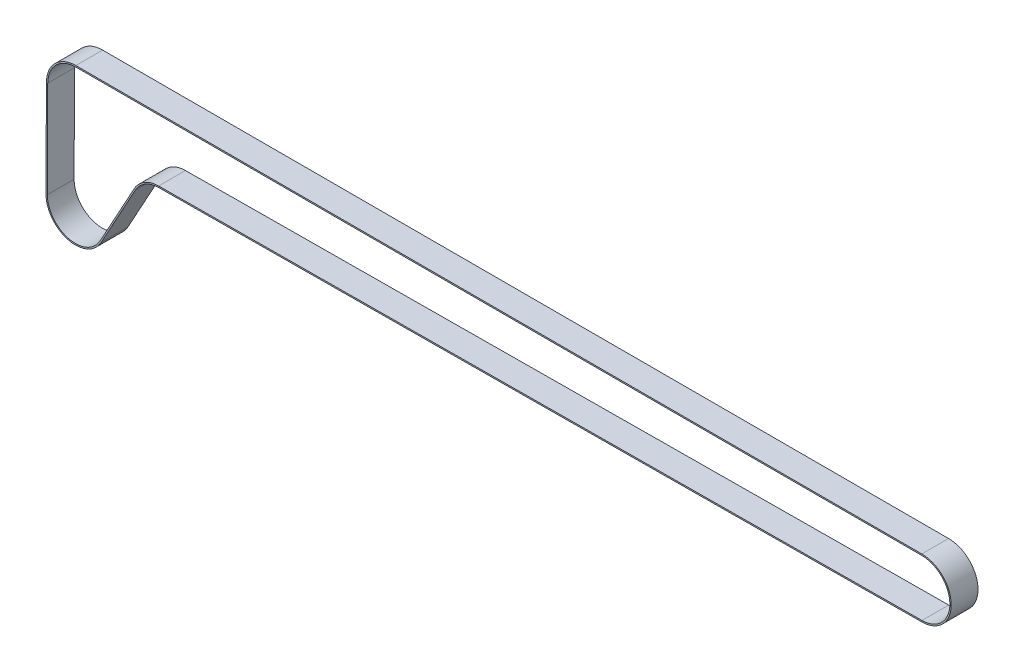
ISO-10303-21;
HEADER;
FILE_DESCRIPTION(('STEP AP214'),'2;1');
FILE_NAME('part.step','',(''),(''),'','','');
FILE_SCHEMA(('AUTOMOTIVE_DESIGN { 1 0 10303 214 1 1 1 1 }'));
ENDSEC;
DATA;
#1=APPLICATION_CONTEXT('core data for automotive mechanical design processes');
#2=APPLICATION_PROTOCOL_DEFINITION('international standard','automotive_design',2000,#1);
#3=PRODUCT_CONTEXT('',#1,'mechanical');
#4=PRODUCT('Part','Part','',(#3));
#5=PRODUCT_RELATED_PRODUCT_CATEGORY('part','',(#4));
#6=PRODUCT_DEFINITION_FORMATION('','',#4);
#7=PRODUCT_DEFINITION_CONTEXT('part definition',#1,'design');
#8=PRODUCT_DEFINITION('design','',#6,#7);
#9=PRODUCT_DEFINITION_SHAPE('','',#8);
#10=(LENGTH_UNIT() NAMED_UNIT(*) SI_UNIT(.MILLI.,.METRE.));
#11=(NAMED_UNIT(*) PLANE_ANGLE_UNIT() SI_UNIT($,.RADIAN.));
#12=(NAMED_UNIT(*) SI_UNIT($,.STERADIAN.) SOLID_ANGLE_UNIT());
#13=UNCERTAINTY_MEASURE_WITH_UNIT(LENGTH_MEASURE(1.E-05),#10,'distance_accuracy_value','');
#14=(GEOMETRIC_REPRESENTATION_CONTEXT(3) GLOBAL_UNCERTAINTY_ASSIGNED_CONTEXT((#13)) GLOBAL_UNIT_ASSIGNED_CONTEXT((#10,
#11,#12)) REPRESENTATION_CONTEXT('',''));
#15=CARTESIAN_POINT('',(0.,0.,0.));
#16=DIRECTION('',(0.,0.,1.));
#17=DIRECTION('',(1.,0.,0.));
#18=AXIS2_PLACEMENT_3D('',#15,#16,#17);
#19=CARTESIAN_POINT('',(-1.33134176832873E-09,-8.50560765364232E-12,2.5));
#20=DIRECTION('',(0.,0.,1.));
#21=DIRECTION('',(1.,0.,0.));
#22=AXIS2_PLACEMENT_3D('',#19,#20,#21);
#23=PLANE('',#22);
#24=CARTESIAN_POINT('',(-1.33134176832873E-09,-8.50560765364232E-12,2.5));
#25=DIRECTION('',(0.,0.,1.));
#26=DIRECTION('',(1.,0.,0.));
#27=AXIS2_PLACEMENT_3D('',#24,#25,#26);
#28=CIRCLE('',#27,11.);
#29=CARTESIAN_POINT('',(0.0771711362803629,-10.999729297383,2.5));
#30=VERTEX_POINT('',#29);
#31=CARTESIAN_POINT('',(0.,10.9999999999915,2.5));
#32=VERTEX_POINT('',#31);
#33=EDGE_CURVE('E259',#30,#32,#28,.T.);
#34=ORIENTED_EDGE('',*,*,#33,.T.);
#35=DIRECTION('',(-1.,0.,0.));
#36=VECTOR('',#35,1.);
#37=CARTESIAN_POINT('',(0.,10.9999999999915,2.5));
#38=LINE('',#37,#36);
#39=CARTESIAN_POINT('',(-316.000000000003,10.9999999999915,2.5));
#40=VERTEX_POINT('',#39);
#41=EDGE_CURVE('E262',#32,#40,#38,.T.);
#42=ORIENTED_EDGE('',*,*,#41,.T.);
#43=CARTESIAN_POINT('',(-316.000000000002,-8.52096171399808E-12,2.5));
#44=DIRECTION('',(0.,0.,1.));
#45=DIRECTION('',(1.,0.,0.));
#46=AXIS2_PLACEMENT_3D('',#43,#44,#45);
#47=CIRCLE('',#46,11.);
#48=CARTESIAN_POINT('',(-326.999905305886,0.0456427605963883,2.5));
#49=VERTEX_POINT('',#48);
#50=EDGE_CURVE('E265',#40,#49,#47,.T.);
#51=ORIENTED_EDGE('',*,*,#50,.T.);
#52=DIRECTION('',(-0.00414934187317357,-0.999991391443956,0.));
#53=VECTOR('',#52,1.);
#54=CARTESIAN_POINT('',(-326.999905305886,0.0456427605963884,2.5));
#55=LINE('',#54,#53);
#56=CARTESIAN_POINT('',(-327.149905305884,-36.1043572394084,2.5));
#57=VERTEX_POINT('',#56);
#58=EDGE_CURVE('E267',#49,#57,#55,.T.);
#59=ORIENTED_EDGE('',*,*,#58,.T.);
#60=CARTESIAN_POINT('',(-316.150000000001,-36.1500000000133,2.5));
#61=DIRECTION('',(0.,0.,1.));
#62=DIRECTION('',(1.,0.,0.));
#63=AXIS2_PLACEMENT_3D('',#60,#61,#62);
#64=CIRCLE('',#63,11.);
#65=CARTESIAN_POINT('',(-306.503020259219,-41.4354310969946,2.5));
#66=VERTEX_POINT('',#65);
#67=EDGE_CURVE('E269',#57,#66,#64,.T.);
#68=ORIENTED_EDGE('',*,*,#67,.T.);
#69=DIRECTION('',(0.480493736089203,0.876998158252934,0.));
#70=VECTOR('',#69,1.);
#71=CARTESIAN_POINT('',(-306.503020259219,-41.4354310969946,2.5));
#72=LINE('',#71,#70);
#73=CARTESIAN_POINT('',(-293.769981582528,-18.1950626391047,2.5));
#74=VERTEX_POINT('',#73);
#75=EDGE_CURVE('E271',#66,#74,#72,.T.);
#76=ORIENTED_EDGE('',*,*,#75,.T.);
#77=CARTESIAN_POINT('',(-284.999999999999,-22.9999999999967,2.5));
#78=DIRECTION('',(0.,0.,1.));
#79=DIRECTION('',(1.,0.,0.));
#80=AXIS2_PLACEMENT_3D('',#77,#78,#79);
#81=CIRCLE('',#80,9.99999999999999);
#82=CARTESIAN_POINT('',(-285.070155578435,-13.0002460932841,2.5));
#83=VERTEX_POINT('',#82);
#84=EDGE_CURVE('E273',#74,#83,#81,.F.);
#85=ORIENTED_EDGE('',*,*,#84,.T.);
#86=DIRECTION('',(0.999975390671262,0.00701555784363707,0.));
#87=VECTOR('',#86,1.);
#88=CARTESIAN_POINT('',(-285.070155578435,-13.0002460932841,2.5));
#89=LINE('',#88,#87);
#90=EDGE_CURVE('E275',#83,#30,#89,.T.);
#91=ORIENTED_EDGE('',*,*,#90,.T.);
#92=EDGE_LOOP('',(#34,#42,#51,#59,#68,#76,#85,#91));
#93=FACE_BOUND('',#92,.T.);
#94=DIRECTION('',(-1.,0.,0.));
#95=VECTOR('',#94,1.);
#96=CARTESIAN_POINT('',(0.,10.4999999999915,2.5));
#97=LINE('',#96,#95);
#98=CARTESIAN_POINT('',(0.,10.4999999999915,2.5));
#99=VERTEX_POINT('',#98);
#100=CARTESIAN_POINT('',(-316.000000000003,10.4999999999915,2.5));
#101=VERTEX_POINT('',#100);
#102=EDGE_CURVE('E202',#99,#101,#97,.T.);
#103=ORIENTED_EDGE('',*,*,#102,.F.);
#104=CARTESIAN_POINT('',(-1.33134176832873E-09,-8.50560765364232E-12,2.5));
#105=DIRECTION('',(0.,0.,1.));
#106=DIRECTION('',(1.,0.,0.));
#107=AXIS2_PLACEMENT_3D('',#104,#105,#106);
#108=CIRCLE('',#107,10.5);
#109=CARTESIAN_POINT('',(0.0736633573585899,-10.4997416020474,2.5));
#110=VERTEX_POINT('',#109);
#111=EDGE_CURVE('E194',#110,#99,#108,.T.);
#112=ORIENTED_EDGE('',*,*,#111,.F.);
#113=DIRECTION('',(0.999975390671262,0.00701555784363707,0.));
#114=VECTOR('',#113,1.);
#115=CARTESIAN_POINT('',(-285.073663357357,-12.5002583979484,2.5));
#116=LINE('',#115,#114);
#117=CARTESIAN_POINT('',(-285.073663357357,-12.5002583979484,2.5));
#118=VERTEX_POINT('',#117);
#119=EDGE_CURVE('E227',#118,#110,#116,.T.);
#120=ORIENTED_EDGE('',*,*,#119,.F.);
#121=CARTESIAN_POINT('',(-284.999999999999,-22.9999999999967,2.5));
#122=DIRECTION('',(0.,0.,-1.));
#123=DIRECTION('',(-1.,0.,0.));
#124=AXIS2_PLACEMENT_3D('',#121,#122,#123);
#125=CIRCLE('',#124,10.5);
#126=CARTESIAN_POINT('',(-294.208480661654,-17.9548157710601,2.5));
#127=VERTEX_POINT('',#126);
#128=EDGE_CURVE('E225',#127,#118,#125,.T.);
#129=ORIENTED_EDGE('',*,*,#128,.F.);
#130=DIRECTION('',(0.480493736089203,0.876998158252934,0.));
#131=VECTOR('',#130,1.);
#132=CARTESIAN_POINT('',(-306.941519338345,-41.19518422895,2.5));
#133=LINE('',#132,#131);
#134=CARTESIAN_POINT('',(-306.941519338345,-41.19518422895,2.5));
#135=VERTEX_POINT('',#134);
#136=EDGE_CURVE('E223',#135,#127,#133,.T.);
#137=ORIENTED_EDGE('',*,*,#136,.F.);
#138=CARTESIAN_POINT('',(-316.150000000001,-36.1500000000133,2.5));
#139=DIRECTION('',(0.,0.,1.));
#140=DIRECTION('',(1.,0.,0.));
#141=AXIS2_PLACEMENT_3D('',#138,#139,#140);
#142=CIRCLE('',#141,10.5);
#143=CARTESIAN_POINT('',(-326.649909610163,-36.106431910345,2.5));
#144=VERTEX_POINT('',#143);
#145=EDGE_CURVE('E221',#144,#135,#142,.T.);
#146=ORIENTED_EDGE('',*,*,#145,.F.);
#147=DIRECTION('',(-0.00414934187317357,-0.999991391443956,0.));
#148=VECTOR('',#147,1.);
#149=CARTESIAN_POINT('',(-326.499909610164,0.0435680896598016,2.5));
#150=LINE('',#149,#148);
#151=CARTESIAN_POINT('',(-326.499909610164,0.0435680896598016,2.5));
#152=VERTEX_POINT('',#151);
#153=EDGE_CURVE('E217',#152,#144,#150,.T.);
#154=ORIENTED_EDGE('',*,*,#153,.F.);
#155=CARTESIAN_POINT('',(-316.000000000002,-8.52096171399808E-12,2.5));
#156=DIRECTION('',(0.,0.,1.));
#157=DIRECTION('',(1.,0.,0.));
#158=AXIS2_PLACEMENT_3D('',#155,#156,#157);
#159=CIRCLE('',#158,10.5);
#160=EDGE_CURVE('E215',#101,#152,#159,.T.);
#161=ORIENTED_EDGE('',*,*,#160,.F.);
#162=EDGE_LOOP('',(#103,#112,#120,#129,#137,#146,#154,#161));
#163=FACE_BOUND('',#162,.T.);
#164=ADVANCED_FACE('F81',(#93,#163),#23,.T.);
#165=CARTESIAN_POINT('',(-1.33134176832873E-09,-8.50560765364232E-12,-7.5));
#166=DIRECTION('',(0.,0.,1.));
#167=DIRECTION('',(1.,0.,0.));
#168=AXIS2_PLACEMENT_3D('',#165,#166,#167);
#169=PLANE('',#168);
#170=CARTESIAN_POINT('',(-1.33134176832873E-09,-8.50560765364232E-12,-7.5));
#171=DIRECTION('',(0.,0.,1.));
#172=DIRECTION('',(1.,0.,0.));
#173=AXIS2_PLACEMENT_3D('',#170,#171,#172);
#174=CIRCLE('',#173,11.);
#175=CARTESIAN_POINT('',(0.0771711362803629,-10.999729297383,-7.5));
#176=VERTEX_POINT('',#175);
#177=CARTESIAN_POINT('',(0.,10.9999999999915,-7.5));
#178=VERTEX_POINT('',#177);
#179=EDGE_CURVE('E210',#176,#178,#174,.T.);
#180=ORIENTED_EDGE('',*,*,#179,.F.);
#181=DIRECTION('',(0.999975390671262,0.00701555784363707,0.));
#182=VECTOR('',#181,1.);
#183=CARTESIAN_POINT('',(-285.070155578435,-13.0002460932841,-7.5));
#184=LINE('',#183,#182);
#185=CARTESIAN_POINT('',(-285.070155578435,-13.0002460932841,-7.5));
#186=VERTEX_POINT('',#185);
#187=EDGE_CURVE('E263',#186,#176,#184,.T.);
#188=ORIENTED_EDGE('',*,*,#187,.F.);
#189=CARTESIAN_POINT('',(-284.999999999999,-22.9999999999967,-7.5));
#190=DIRECTION('',(0.,0.,1.));
#191=DIRECTION('',(1.,0.,0.));
#192=AXIS2_PLACEMENT_3D('',#189,#190,#191);
#193=CIRCLE('',#192,9.99999999999999);
#194=CARTESIAN_POINT('',(-293.769981582528,-18.1950626391047,-7.5));
#195=VERTEX_POINT('',#194);
#196=EDGE_CURVE('E290',#195,#186,#193,.F.);
#197=ORIENTED_EDGE('',*,*,#196,.F.);
#198=DIRECTION('',(0.480493736089203,0.876998158252934,0.));
#199=VECTOR('',#198,1.);
#200=CARTESIAN_POINT('',(-306.503020259219,-41.4354310969946,-7.5));
#201=LINE('',#200,#199);
#202=CARTESIAN_POINT('',(-306.503020259219,-41.4354310969946,-7.5));
#203=VERTEX_POINT('',#202);
#204=EDGE_CURVE('E288',#203,#195,#201,.T.);
#205=ORIENTED_EDGE('',*,*,#204,.F.);
#206=CARTESIAN_POINT('',(-316.150000000001,-36.1500000000133,-7.5));
#207=DIRECTION('',(0.,0.,1.));
#208=DIRECTION('',(1.,0.,0.));
#209=AXIS2_PLACEMENT_3D('',#206,#207,#208);
#210=CIRCLE('',#209,11.);
#211=CARTESIAN_POINT('',(-327.149905305884,-36.1043572394084,-7.5));
#212=VERTEX_POINT('',#211);
#213=EDGE_CURVE('E286',#212,#203,#210,.T.);
#214=ORIENTED_EDGE('',*,*,#213,.F.);
#215=DIRECTION('',(-0.00414934187317357,-0.999991391443956,0.));
#216=VECTOR('',#215,1.);
#217=CARTESIAN_POINT('',(-326.999905305886,0.0456427605963884,-7.5));
#218=LINE('',#217,#216);
#219=CARTESIAN_POINT('',(-326.999905305886,0.0456427605963883,-7.5));
#220=VERTEX_POINT('',#219);
#221=EDGE_CURVE('E284',#220,#212,#218,.T.);
#222=ORIENTED_EDGE('',*,*,#221,.F.);
#223=CARTESIAN_POINT('',(-316.000000000002,-8.52096171399808E-12,-7.5));
#224=DIRECTION('',(0.,0.,1.));
#225=DIRECTION('',(1.,0.,0.));
#226=AXIS2_PLACEMENT_3D('',#223,#224,#225);
#227=CIRCLE('',#226,11.);
#228=CARTESIAN_POINT('',(-316.000000000003,10.9999999999915,-7.5));
#229=VERTEX_POINT('',#228);
#230=EDGE_CURVE('E282',#229,#220,#227,.T.);
#231=ORIENTED_EDGE('',*,*,#230,.F.);
#232=DIRECTION('',(-1.,0.,0.));
#233=VECTOR('',#232,1.);
#234=CARTESIAN_POINT('',(0.,10.9999999999915,-7.5));
#235=LINE('',#234,#233);
#236=EDGE_CURVE('E280',#178,#229,#235,.T.);
#237=ORIENTED_EDGE('',*,*,#236,.F.);
#238=EDGE_LOOP('',(#180,#188,#197,#205,#214,#222,#231,#237));
#239=FACE_BOUND('',#238,.T.);
#240=CARTESIAN_POINT('',(-1.33134176832873E-09,-8.50560765364232E-12,-7.5));
#241=DIRECTION('',(0.,0.,1.));
#242=DIRECTION('',(1.,0.,0.));
#243=AXIS2_PLACEMENT_3D('',#240,#241,#242);
#244=CIRCLE('',#243,10.5);
#245=CARTESIAN_POINT('',(0.0736633573585899,-10.4997416020474,-7.5));
#246=VERTEX_POINT('',#245);
#247=CARTESIAN_POINT('',(0.,10.4999999999915,-7.5));
#248=VERTEX_POINT('',#247);
#249=EDGE_CURVE('E104',#246,#248,#244,.T.);
#250=ORIENTED_EDGE('',*,*,#249,.T.);
#251=DIRECTION('',(-1.,0.,0.));
#252=VECTOR('',#251,1.);
#253=CARTESIAN_POINT('',(0.,10.4999999999915,-7.5));
#254=LINE('',#253,#252);
#255=CARTESIAN_POINT('',(-316.000000000003,10.4999999999915,-7.5));
#256=VERTEX_POINT('',#255);
#257=EDGE_CURVE('E209',#248,#256,#254,.T.);
#258=ORIENTED_EDGE('',*,*,#257,.T.);
#259=CARTESIAN_POINT('',(-316.000000000002,-8.52096171399808E-12,-7.5));
#260=DIRECTION('',(0.,0.,1.));
#261=DIRECTION('',(1.,0.,0.));
#262=AXIS2_PLACEMENT_3D('',#259,#260,#261);
#263=CIRCLE('',#262,10.5);
#264=CARTESIAN_POINT('',(-326.499909610164,0.0435680896598016,-7.5));
#265=VERTEX_POINT('',#264);
#266=EDGE_CURVE('E231',#256,#265,#263,.T.);
#267=ORIENTED_EDGE('',*,*,#266,.T.);
#268=DIRECTION('',(-0.00414934187317357,-0.999991391443956,0.));
#269=VECTOR('',#268,1.);
#270=CARTESIAN_POINT('',(-326.499909610164,0.0435680896598016,-7.5));
#271=LINE('',#270,#269);
#272=CARTESIAN_POINT('',(-326.649909610163,-36.106431910345,-7.5));
#273=VERTEX_POINT('',#272);
#274=EDGE_CURVE('E234',#265,#273,#271,.T.);
#275=ORIENTED_EDGE('',*,*,#274,.T.);
#276=CARTESIAN_POINT('',(-316.150000000001,-36.1500000000133,-7.5));
#277=DIRECTION('',(0.,0.,1.));
#278=DIRECTION('',(1.,0.,0.));
#279=AXIS2_PLACEMENT_3D('',#276,#277,#278);
#280=CIRCLE('',#279,10.5);
#281=CARTESIAN_POINT('',(-306.941519338345,-41.19518422895,-7.5));
#282=VERTEX_POINT('',#281);
#283=EDGE_CURVE('E237',#273,#282,#280,.T.);
#284=ORIENTED_EDGE('',*,*,#283,.T.);
#285=DIRECTION('',(0.480493736089203,0.876998158252934,0.));
#286=VECTOR('',#285,1.);
#287=CARTESIAN_POINT('',(-306.941519338345,-41.19518422895,-7.5));
#288=LINE('',#287,#286);
#289=CARTESIAN_POINT('',(-294.208480661654,-17.9548157710601,-7.5));
#290=VERTEX_POINT('',#289);
#291=EDGE_CURVE('E240',#282,#290,#288,.T.);
#292=ORIENTED_EDGE('',*,*,#291,.T.);
#293=CARTESIAN_POINT('',(-284.999999999999,-22.9999999999967,-7.5));
#294=DIRECTION('',(0.,0.,-1.));
#295=DIRECTION('',(-1.,0.,0.));
#296=AXIS2_PLACEMENT_3D('',#293,#294,#295);
#297=CIRCLE('',#296,10.5);
#298=CARTESIAN_POINT('',(-285.073663357357,-12.5002583979484,-7.5));
#299=VERTEX_POINT('',#298);
#300=EDGE_CURVE('E243',#290,#299,#297,.T.);
#301=ORIENTED_EDGE('',*,*,#300,.T.);
#302=DIRECTION('',(0.999975390671262,0.00701555784363707,0.));
#303=VECTOR('',#302,1.);
#304=CARTESIAN_POINT('',(-285.073663357357,-12.5002583979484,-7.5));
#305=LINE('',#304,#303);
#306=EDGE_CURVE('E203',#299,#246,#305,.T.);
#307=ORIENTED_EDGE('',*,*,#306,.T.);
#308=EDGE_LOOP('',(#250,#258,#267,#275,#284,#292,#301,#307));
#309=FACE_BOUND('',#308,.T.);
#310=ADVANCED_FACE('F320',(#239,#309),#169,.F.);
#311=CARTESIAN_POINT('',(-1.33134176832873E-09,-8.50560765364232E-12,2.5));
#312=DIRECTION('',(0.,0.,-1.));
#313=DIRECTION('',(-1.,0.,0.));
#314=AXIS2_PLACEMENT_3D('',#311,#312,#313);
#315=CYLINDRICAL_SURFACE('',#314,11.);
#316=ORIENTED_EDGE('',*,*,#179,.T.);
#317=DIRECTION('',(0.,0.,-1.));
#318=VECTOR('',#317,1.);
#319=CARTESIAN_POINT('',(0.,10.9999999999915,2.5));
#320=LINE('',#319,#318);
#321=EDGE_CURVE('E12',#32,#178,#320,.T.);
#322=ORIENTED_EDGE('',*,*,#321,.F.);
#323=ORIENTED_EDGE('',*,*,#33,.F.);
#324=DIRECTION('',(0.,0.,-1.));
#325=VECTOR('',#324,1.);
#326=CARTESIAN_POINT('',(0.0771711362803629,-10.999729297383,2.5));
#327=LINE('',#326,#325);
#328=EDGE_CURVE('E277',#30,#176,#327,.T.);
#329=ORIENTED_EDGE('',*,*,#328,.T.);
#330=EDGE_LOOP('',(#316,#322,#323,#329));
#331=FACE_BOUND('',#330,.T.);
#332=ADVANCED_FACE('F83',(#331),#315,.T.);
#333=CARTESIAN_POINT('',(0.,10.9999999999915,2.5));
#334=DIRECTION('',(0.,-1.,0.));
#335=DIRECTION('',(1.,0.,0.));
#336=AXIS2_PLACEMENT_3D('',#333,#334,#335);
#337=PLANE('',#336);
#338=ORIENTED_EDGE('',*,*,#236,.T.);
#339=DIRECTION('',(0.,0.,-1.));
#340=VECTOR('',#339,1.);
#341=CARTESIAN_POINT('',(-316.000000000003,10.9999999999915,2.5));
#342=LINE('',#341,#340);
#343=EDGE_CURVE('E89',#40,#229,#342,.T.);
#344=ORIENTED_EDGE('',*,*,#343,.F.);
#345=ORIENTED_EDGE('',*,*,#41,.F.);
#346=ORIENTED_EDGE('',*,*,#321,.T.);
#347=EDGE_LOOP('',(#338,#344,#345,#346));
#348=FACE_BOUND('',#347,.T.);
#349=ADVANCED_FACE('F337',(#348),#337,.F.);
#350=CARTESIAN_POINT('',(-316.000000000002,-8.52096171399808E-12,2.5));
#351=DIRECTION('',(0.,0.,-1.));
#352=DIRECTION('',(-1.,0.,0.));
#353=AXIS2_PLACEMENT_3D('',#350,#351,#352);
#354=CYLINDRICAL_SURFACE('',#353,11.);
#355=ORIENTED_EDGE('',*,*,#230,.T.);
#356=DIRECTION('',(0.,0.,-1.));
#357=VECTOR('',#356,1.);
#358=CARTESIAN_POINT('',(-326.999905305886,0.0456427605963883,2.5));
#359=LINE('',#358,#357);
#360=EDGE_CURVE('E307',#49,#220,#359,.T.);
#361=ORIENTED_EDGE('',*,*,#360,.F.);
#362=ORIENTED_EDGE('',*,*,#50,.F.);
#363=ORIENTED_EDGE('',*,*,#343,.T.);
#364=EDGE_LOOP('',(#355,#361,#362,#363));
#365=FACE_BOUND('',#364,.T.);
#366=ADVANCED_FACE('F314',(#365),#354,.T.);
#367=CARTESIAN_POINT('',(-326.999905305886,0.0456427605963884,2.5));
#368=DIRECTION('',(0.999991391443956,-0.00414934187317357,0.));
#369=DIRECTION('',(0.00414934187317357,0.999991391443956,0.));
#370=AXIS2_PLACEMENT_3D('',#367,#368,#369);
#371=PLANE('',#370);
#372=ORIENTED_EDGE('',*,*,#221,.T.);
#373=DIRECTION('',(0.,0.,-1.));
#374=VECTOR('',#373,1.);
#375=CARTESIAN_POINT('',(-327.149905305884,-36.1043572394084,2.5));
#376=LINE('',#375,#374);
#377=EDGE_CURVE('E304',#57,#212,#376,.T.);
#378=ORIENTED_EDGE('',*,*,#377,.F.);
#379=ORIENTED_EDGE('',*,*,#58,.F.);
#380=ORIENTED_EDGE('',*,*,#360,.T.);
#381=EDGE_LOOP('',(#372,#378,#379,#380));
#382=FACE_BOUND('',#381,.T.);
#383=ADVANCED_FACE('F326',(#382),#371,.F.);
#384=CARTESIAN_POINT('',(-316.150000000001,-36.1500000000133,2.5));
#385=DIRECTION('',(0.,0.,-1.));
#386=DIRECTION('',(-1.,0.,0.));
#387=AXIS2_PLACEMENT_3D('',#384,#385,#386);
#388=CYLINDRICAL_SURFACE('',#387,11.);
#389=ORIENTED_EDGE('',*,*,#213,.T.);
#390=DIRECTION('',(0.,0.,-1.));
#391=VECTOR('',#390,1.);
#392=CARTESIAN_POINT('',(-306.503020259219,-41.4354310969946,2.5));
#393=LINE('',#392,#391);
#394=EDGE_CURVE('E301',#66,#203,#393,.T.);
#395=ORIENTED_EDGE('',*,*,#394,.F.);
#396=ORIENTED_EDGE('',*,*,#67,.F.);
#397=ORIENTED_EDGE('',*,*,#377,.T.);
#398=EDGE_LOOP('',(#389,#395,#396,#397));
#399=FACE_BOUND('',#398,.T.);
#400=ADVANCED_FACE('F330',(#399),#388,.T.);
#401=CARTESIAN_POINT('',(-306.503020259219,-41.4354310969946,2.5));
#402=DIRECTION('',(-0.876998158252934,0.480493736089203,0.));
#403=DIRECTION('',(-0.480493736089203,-0.876998158252934,0.));
#404=AXIS2_PLACEMENT_3D('',#401,#402,#403);
#405=PLANE('',#404);
#406=ORIENTED_EDGE('',*,*,#204,.T.);
#407=DIRECTION('',(0.,0.,-1.));
#408=VECTOR('',#407,1.);
#409=CARTESIAN_POINT('',(-293.769981582528,-18.1950626391047,2.5));
#410=LINE('',#409,#408);
#411=EDGE_CURVE('E298',#74,#195,#410,.T.);
#412=ORIENTED_EDGE('',*,*,#411,.F.);
#413=ORIENTED_EDGE('',*,*,#75,.F.);
#414=ORIENTED_EDGE('',*,*,#394,.T.);
#415=EDGE_LOOP('',(#406,#412,#413,#414));
#416=FACE_BOUND('',#415,.T.);
#417=ADVANCED_FACE('F350',(#416),#405,.F.);
#418=CARTESIAN_POINT('',(-284.999999999999,-22.9999999999967,2.5));
#419=DIRECTION('',(0.,0.,-1.));
#420=DIRECTION('',(-1.,0.,0.));
#421=AXIS2_PLACEMENT_3D('',#418,#419,#420);
#422=CYLINDRICAL_SURFACE('',#421,9.99999999999999);
#423=ORIENTED_EDGE('',*,*,#196,.T.);
#424=DIRECTION('',(0.,0.,-1.));
#425=VECTOR('',#424,1.);
#426=CARTESIAN_POINT('',(-285.070155578435,-13.0002460932841,2.5));
#427=LINE('',#426,#425);
#428=EDGE_CURVE('E295',#83,#186,#427,.T.);
#429=ORIENTED_EDGE('',*,*,#428,.F.);
#430=ORIENTED_EDGE('',*,*,#84,.F.);
#431=ORIENTED_EDGE('',*,*,#411,.T.);
#432=EDGE_LOOP('',(#423,#429,#430,#431));
#433=FACE_BOUND('',#432,.T.);
#434=ADVANCED_FACE('F348',(#433),#422,.F.);
#435=CARTESIAN_POINT('',(-285.070155578435,-13.0002460932841,2.5));
#436=DIRECTION('',(-0.00701555784363707,0.999975390671262,0.));
#437=DIRECTION('',(-0.999975390671262,-0.00701555784363707,0.));
#438=AXIS2_PLACEMENT_3D('',#435,#436,#437);
#439=PLANE('',#438);
#440=ORIENTED_EDGE('',*,*,#187,.T.);
#441=ORIENTED_EDGE('',*,*,#328,.F.);
#442=ORIENTED_EDGE('',*,*,#90,.F.);
#443=ORIENTED_EDGE('',*,*,#428,.T.);
#444=EDGE_LOOP('',(#440,#441,#442,#443));
#445=FACE_BOUND('',#444,.T.);
#446=ADVANCED_FACE('F343',(#445),#439,.F.);
#447=CARTESIAN_POINT('',(-1.33134176832873E-09,-8.50560765364232E-12,2.5));
#448=DIRECTION('',(0.,0.,-1.));
#449=DIRECTION('',(-1.,0.,0.));
#450=AXIS2_PLACEMENT_3D('',#447,#448,#449);
#451=CYLINDRICAL_SURFACE('',#450,10.5);
#452=ORIENTED_EDGE('',*,*,#249,.F.);
#453=DIRECTION('',(0.,0.,-1.));
#454=VECTOR('',#453,1.);
#455=CARTESIAN_POINT('',(0.0736633573585899,-10.4997416020474,2.5));
#456=LINE('',#455,#454);
#457=EDGE_CURVE('E198',#110,#246,#456,.T.);
#458=ORIENTED_EDGE('',*,*,#457,.F.);
#459=ORIENTED_EDGE('',*,*,#111,.T.);
#460=DIRECTION('',(0.,0.,-1.));
#461=VECTOR('',#460,1.);
#462=CARTESIAN_POINT('',(0.,10.4999999999915,2.5));
#463=LINE('',#462,#461);
#464=EDGE_CURVE('E197',#99,#248,#463,.T.);
#465=ORIENTED_EDGE('',*,*,#464,.T.);
#466=EDGE_LOOP('',(#452,#458,#459,#465));
#467=FACE_BOUND('',#466,.T.);
#468=ADVANCED_FACE('F196',(#467),#451,.F.);
#469=CARTESIAN_POINT('',(0.,10.4999999999915,2.5));
#470=DIRECTION('',(0.,-1.,0.));
#471=DIRECTION('',(1.,0.,0.));
#472=AXIS2_PLACEMENT_3D('',#469,#470,#471);
#473=PLANE('',#472);
#474=ORIENTED_EDGE('',*,*,#257,.F.);
#475=ORIENTED_EDGE('',*,*,#464,.F.);
#476=ORIENTED_EDGE('',*,*,#102,.T.);
#477=DIRECTION('',(0.,0.,-1.));
#478=VECTOR('',#477,1.);
#479=CARTESIAN_POINT('',(-316.000000000003,10.4999999999915,2.5));
#480=LINE('',#479,#478);
#481=EDGE_CURVE('E211',#101,#256,#480,.T.);
#482=ORIENTED_EDGE('',*,*,#481,.T.);
#483=EDGE_LOOP('',(#474,#475,#476,#482));
#484=FACE_BOUND('',#483,.T.);
#485=ADVANCED_FACE('F206',(#484),#473,.T.);
#486=CARTESIAN_POINT('',(-316.000000000002,-8.52096171399808E-12,2.5));
#487=DIRECTION('',(0.,0.,-1.));
#488=DIRECTION('',(-1.,0.,0.));
#489=AXIS2_PLACEMENT_3D('',#486,#487,#488);
#490=CYLINDRICAL_SURFACE('',#489,10.5);
#491=ORIENTED_EDGE('',*,*,#266,.F.);
#492=ORIENTED_EDGE('',*,*,#481,.F.);
#493=ORIENTED_EDGE('',*,*,#160,.T.);
#494=DIRECTION('',(0.,0.,-1.));
#495=VECTOR('',#494,1.);
#496=CARTESIAN_POINT('',(-326.499909610164,0.0435680896598016,2.5));
#497=LINE('',#496,#495);
#498=EDGE_CURVE('E256',#152,#265,#497,.T.);
#499=ORIENTED_EDGE('',*,*,#498,.T.);
#500=EDGE_LOOP('',(#491,#492,#493,#499));
#501=FACE_BOUND('',#500,.T.);
#502=ADVANCED_FACE('F375',(#501),#490,.F.);
#503=CARTESIAN_POINT('',(-326.499909610164,0.0435680896598016,2.5));
#504=DIRECTION('',(0.999991391443956,-0.00414934187317357,0.));
#505=DIRECTION('',(0.00414934187317357,0.999991391443956,0.));
#506=AXIS2_PLACEMENT_3D('',#503,#504,#505);
#507=PLANE('',#506);
#508=ORIENTED_EDGE('',*,*,#274,.F.);
#509=ORIENTED_EDGE('',*,*,#498,.F.);
#510=ORIENTED_EDGE('',*,*,#153,.T.);
#511=DIRECTION('',(0.,0.,-1.));
#512=VECTOR('',#511,1.);
#513=CARTESIAN_POINT('',(-326.649909610163,-36.106431910345,2.5));
#514=LINE('',#513,#512);
#515=EDGE_CURVE('E254',#144,#273,#514,.T.);
#516=ORIENTED_EDGE('',*,*,#515,.T.);
#517=EDGE_LOOP('',(#508,#509,#510,#516));
#518=FACE_BOUND('',#517,.T.);
#519=ADVANCED_FACE('F379',(#518),#507,.T.);
#520=CARTESIAN_POINT('',(-316.150000000001,-36.1500000000133,2.5));
#521=DIRECTION('',(0.,0.,-1.));
#522=DIRECTION('',(-1.,0.,0.));
#523=AXIS2_PLACEMENT_3D('',#520,#521,#522);
#524=CYLINDRICAL_SURFACE('',#523,10.5);
#525=ORIENTED_EDGE('',*,*,#283,.F.);
#526=ORIENTED_EDGE('',*,*,#515,.F.);
#527=ORIENTED_EDGE('',*,*,#145,.T.);
#528=DIRECTION('',(0.,0.,-1.));
#529=VECTOR('',#528,1.);
#530=CARTESIAN_POINT('',(-306.941519338345,-41.19518422895,2.5));
#531=LINE('',#530,#529);
#532=EDGE_CURVE('E252',#135,#282,#531,.T.);
#533=ORIENTED_EDGE('',*,*,#532,.T.);
#534=EDGE_LOOP('',(#525,#526,#527,#533));
#535=FACE_BOUND('',#534,.T.);
#536=ADVANCED_FACE('F385',(#535),#524,.F.);
#537=CARTESIAN_POINT('',(-306.941519338345,-41.19518422895,2.5));
#538=DIRECTION('',(-0.876998158252934,0.480493736089203,0.));
#539=DIRECTION('',(-0.480493736089203,-0.876998158252934,0.));
#540=AXIS2_PLACEMENT_3D('',#537,#538,#539);
#541=PLANE('',#540);
#542=ORIENTED_EDGE('',*,*,#291,.F.);
#543=ORIENTED_EDGE('',*,*,#532,.F.);
#544=ORIENTED_EDGE('',*,*,#136,.T.);
#545=DIRECTION('',(0.,0.,-1.));
#546=VECTOR('',#545,1.);
#547=CARTESIAN_POINT('',(-294.208480661654,-17.9548157710601,2.5));
#548=LINE('',#547,#546);
#549=EDGE_CURVE('E250',#127,#290,#548,.T.);
#550=ORIENTED_EDGE('',*,*,#549,.T.);
#551=EDGE_LOOP('',(#542,#543,#544,#550));
#552=FACE_BOUND('',#551,.T.);
#553=ADVANCED_FACE('F389',(#552),#541,.T.);
#554=CARTESIAN_POINT('',(-284.999999999999,-22.9999999999967,2.5));
#555=DIRECTION('',(0.,0.,-1.));
#556=DIRECTION('',(-1.,0.,0.));
#557=AXIS2_PLACEMENT_3D('',#554,#555,#556);
#558=CYLINDRICAL_SURFACE('',#557,10.5);
#559=ORIENTED_EDGE('',*,*,#300,.F.);
#560=ORIENTED_EDGE('',*,*,#549,.F.);
#561=ORIENTED_EDGE('',*,*,#128,.T.);
#562=DIRECTION('',(0.,0.,-1.));
#563=VECTOR('',#562,1.);
#564=CARTESIAN_POINT('',(-285.073663357357,-12.5002583979484,2.5));
#565=LINE('',#564,#563);
#566=EDGE_CURVE('E96',#118,#299,#565,.T.);
#567=ORIENTED_EDGE('',*,*,#566,.T.);
#568=EDGE_LOOP('',(#559,#560,#561,#567));
#569=FACE_BOUND('',#568,.T.);
#570=ADVANCED_FACE('F393',(#569),#558,.T.);
#571=CARTESIAN_POINT('',(-285.073663357357,-12.5002583979484,2.5));
#572=DIRECTION('',(-0.00701555784363707,0.999975390671262,0.));
#573=DIRECTION('',(-0.999975390671262,-0.00701555784363707,0.));
#574=AXIS2_PLACEMENT_3D('',#571,#572,#573);
#575=PLANE('',#574);
#576=ORIENTED_EDGE('',*,*,#306,.F.);
#577=ORIENTED_EDGE('',*,*,#566,.F.);
#578=ORIENTED_EDGE('',*,*,#119,.T.);
#579=ORIENTED_EDGE('',*,*,#457,.T.);
#580=EDGE_LOOP('',(#576,#577,#578,#579));
#581=FACE_BOUND('',#580,.T.);
#582=ADVANCED_FACE('F397',(#581),#575,.T.);
#583=CLOSED_SHELL('',(#164,#310,#332,#349,#366,#383,#400,#417,#434,#446,#468,#485,#502,#519,
#536,#553,#570,#582));
#584=MANIFOLD_SOLID_BREP('B2',#583);
#585=ADVANCED_BREP_SHAPE_REPRESENTATION('',(#18,#584),#14);
#586=SHAPE_DEFINITION_REPRESENTATION(#9,#585);
ENDSEC;
END-ISO-10303-21;
